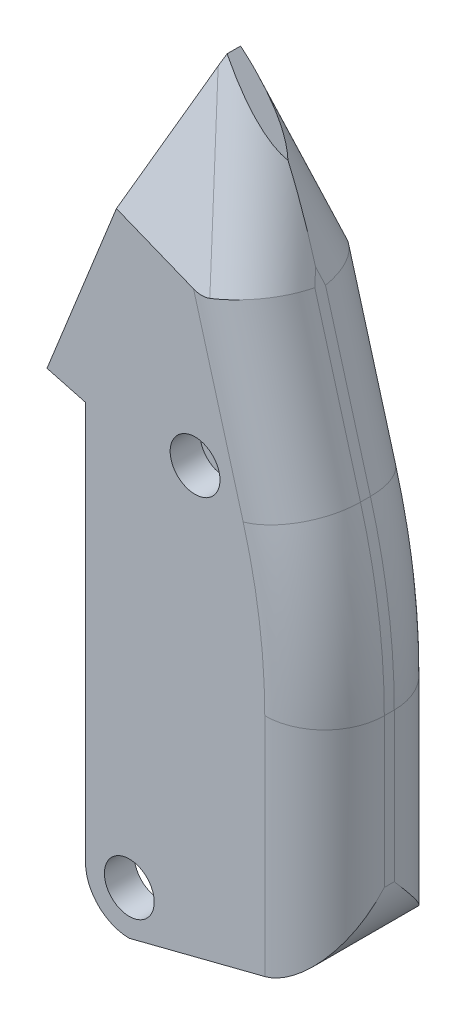
ISO-10303-21;
HEADER;
FILE_DESCRIPTION(('STEP AP214'),'2;1');
FILE_NAME('part.step','',(''),(''),'','','');
FILE_SCHEMA(('AUTOMOTIVE_DESIGN { 1 0 10303 214 1 1 1 1 }'));
ENDSEC;
DATA;
#1=APPLICATION_CONTEXT('core data for automotive mechanical design processes');
#2=APPLICATION_PROTOCOL_DEFINITION('international standard','automotive_design',2000,#1);
#3=PRODUCT_CONTEXT('',#1,'mechanical');
#4=PRODUCT('Part','Part','',(#3));
#5=PRODUCT_RELATED_PRODUCT_CATEGORY('part','',(#4));
#6=PRODUCT_DEFINITION_FORMATION('','',#4);
#7=PRODUCT_DEFINITION_CONTEXT('part definition',#1,'design');
#8=PRODUCT_DEFINITION('design','',#6,#7);
#9=PRODUCT_DEFINITION_SHAPE('','',#8);
#10=(LENGTH_UNIT() NAMED_UNIT(*) SI_UNIT(.MILLI.,.METRE.));
#11=(NAMED_UNIT(*) PLANE_ANGLE_UNIT() SI_UNIT($,.RADIAN.));
#12=(NAMED_UNIT(*) SI_UNIT($,.STERADIAN.) SOLID_ANGLE_UNIT());
#13=UNCERTAINTY_MEASURE_WITH_UNIT(LENGTH_MEASURE(1.E-05),#10,'distance_accuracy_value','');
#14=(GEOMETRIC_REPRESENTATION_CONTEXT(3) GLOBAL_UNCERTAINTY_ASSIGNED_CONTEXT((#13)) GLOBAL_UNIT_ASSIGNED_CONTEXT((#10,
#11,#12)) REPRESENTATION_CONTEXT('',''));
#15=CARTESIAN_POINT('',(0.,0.,0.));
#16=DIRECTION('',(0.,0.,1.));
#17=DIRECTION('',(1.,0.,0.));
#18=AXIS2_PLACEMENT_3D('',#15,#16,#17);
#19=CARTESIAN_POINT('',(15.6745495031514,4.39337889240954,3.25));
#20=DIRECTION('',(0.962892130260791,0.269886541868682,0.));
#21=DIRECTION('',(-0.269886541868682,0.962892130260791,0.));
#22=AXIS2_PLACEMENT_3D('',#19,#20,#21);
#23=PLANE('',#22);
#24=DIRECTION('',(-0.256891711883263,0.916529612736203,-0.306561767582509));
#25=VECTOR('',#24,1.);
#26=CARTESIAN_POINT('',(9.13133192408431,27.7380505823872,0.988569777283912));
#27=LINE('',#26,#25);
#28=CARTESIAN_POINT('',(8.31980787462291,30.6333788019172,0.0201374163689158));
#29=VERTEX_POINT('',#28);
#30=CARTESIAN_POINT('',(8.51242743404336,29.9461572138526,0.25));
#31=VERTEX_POINT('',#30);
#32=EDGE_CURVE('E532',#29,#31,#27,.F.);
#33=ORIENTED_EDGE('',*,*,#32,.T.);
#34=DIRECTION('',(0.269886541868682,-0.962892130260791,0.));
#35=VECTOR('',#34,1.);
#36=CARTESIAN_POINT('',(15.6745495031514,4.39337889240954,0.25));
#37=LINE('',#36,#35);
#38=CARTESIAN_POINT('',(10.8051265943974,21.7663422320644,0.250000000000001));
#39=VERTEX_POINT('',#38);
#40=EDGE_CURVE('E541',#31,#39,#37,.T.);
#41=ORIENTED_EDGE('',*,*,#40,.T.);
#42=DIRECTION('',(0.,0.,-1.));
#43=VECTOR('',#42,1.);
#44=CARTESIAN_POINT('',(10.8051265943974,21.7663422320644,3.25));
#45=LINE('',#44,#43);
#46=CARTESIAN_POINT('',(10.8051265943974,21.7663422320644,-0.249999999999999));
#47=VERTEX_POINT('',#46);
#48=EDGE_CURVE('E430',#39,#47,#45,.T.);
#49=ORIENTED_EDGE('',*,*,#48,.T.);
#50=DIRECTION('',(0.269886541868682,-0.962892130260791,0.));
#51=VECTOR('',#50,1.);
#52=CARTESIAN_POINT('',(15.6745495031514,4.39337889240954,-0.25));
#53=LINE('',#52,#51);
#54=CARTESIAN_POINT('',(8.54947734160673,29.8139717992979,-0.25));
#55=VERTEX_POINT('',#54);
#56=EDGE_CURVE('E536',#47,#55,#53,.F.);
#57=ORIENTED_EDGE('',*,*,#56,.T.);
#58=DIRECTION('',(-0.257236862314935,0.917761028842069,0.302562209479497));
#59=VECTOR('',#58,1.);
#60=CARTESIAN_POINT('',(14.7498871396659,7.6923581849071,-7.54292711509717));
#61=LINE('',#60,#59);
#62=EDGE_CURVE('E489',#55,#29,#61,.T.);
#63=ORIENTED_EDGE('',*,*,#62,.T.);
#64=EDGE_LOOP('',(#33,#41,#49,#57,#63));
#65=FACE_BOUND('',#64,.T.);
#66=ADVANCED_FACE('F55',(#65),#23,.T.);
#67=CARTESIAN_POINT('',(21.0816067768218,16.7397778493892,3.25));
#68=DIRECTION('',(0.783137949458292,0.621848013680403,0.));
#69=DIRECTION('',(-0.621848013680403,0.783137949458291,0.));
#70=AXIS2_PLACEMENT_3D('',#67,#68,#69);
#71=PLANE('',#70);
#72=DIRECTION('',(0.,0.,-1.));
#73=VECTOR('',#72,1.);
#74=CARTESIAN_POINT('',(4.2,38.,3.25));
#75=LINE('',#74,#73);
#76=CARTESIAN_POINT('',(4.2,38.,0.341040163928345));
#77=VERTEX_POINT('',#76);
#78=CARTESIAN_POINT('',(4.2,38.,-0.334765480072377));
#79=VERTEX_POINT('',#78);
#80=EDGE_CURVE('E424',#77,#79,#75,.T.);
#81=ORIENTED_EDGE('',*,*,#80,.F.);
#82=CARTESIAN_POINT('',(2.56081248950632,40.0643467816968,-3.40515823827877));
#83=DIRECTION('',(0.783137949458292,0.621848013680403,0.));
#84=DIRECTION('',(0.587055054774574,-0.739320672738483,0.329804950728668));
#85=AXIS2_PLACEMENT_3D('',#82,#83,#84);
#86=ELLIPSE('',#85,8.13536221615661,3.);
#87=CARTESIAN_POINT('',(6.92420874752517,34.569207900486,0.0113898786200839));
#88=VERTEX_POINT('',#87);
#89=EDGE_CURVE('E456',#77,#88,#86,.T.);
#90=ORIENTED_EDGE('',*,*,#89,.T.);
#91=CARTESIAN_POINT('',(2.56081248950632,40.0643467816968,3.39620898333385));
#92=DIRECTION('',(0.783137949458292,0.621848013680403,0.));
#93=DIRECTION('',(-0.58796822839997,0.740470697993463,0.325571048782405));
#94=AXIS2_PLACEMENT_3D('',#91,#92,#93);
#95=ELLIPSE('',#94,8.12444650308404,3.);
#96=EDGE_CURVE('E444',#88,#79,#95,.T.);
#97=ORIENTED_EDGE('',*,*,#96,.T.);
#98=EDGE_LOOP('',(#81,#90,#97));
#99=FACE_BOUND('',#98,.T.);
#100=ADVANCED_FACE('F370',(#99),#71,.T.);
#101=CARTESIAN_POINT('',(0.,0.,-3.25));
#102=DIRECTION('',(0.,0.,-1.));
#103=DIRECTION('',(1.,0.,0.));
#104=AXIS2_PLACEMENT_3D('',#101,#102,#103);
#105=PLANE('',#104);
#106=CARTESIAN_POINT('',(5.5,22.2,-3.25));
#107=DIRECTION('',(0.,0.,-1.));
#108=DIRECTION('',(-1.,0.,0.));
#109=AXIS2_PLACEMENT_3D('',#106,#107,#108);
#110=CIRCLE('',#109,1.25);
#111=CARTESIAN_POINT('',(4.25,22.2,-3.25));
#112=VERTEX_POINT('',#111);
#113=EDGE_CURVE('E611',#112,#112,#110,.T.);
#114=ORIENTED_EDGE('',*,*,#113,.F.);
#115=EDGE_LOOP('',(#114));
#116=FACE_BOUND('',#115,.T.);
#117=CARTESIAN_POINT('',(2.2,2.2,-3.25));
#118=DIRECTION('',(0.,0.,-1.));
#119=DIRECTION('',(-1.,0.,0.));
#120=AXIS2_PLACEMENT_3D('',#117,#118,#119);
#121=CIRCLE('',#120,1.25);
#122=CARTESIAN_POINT('',(0.95,2.2,-3.25));
#123=VERTEX_POINT('',#122);
#124=EDGE_CURVE('E463',#123,#123,#121,.T.);
#125=ORIENTED_EDGE('',*,*,#124,.F.);
#126=EDGE_LOOP('',(#125));
#127=FACE_BOUND('',#126,.T.);
#128=DIRECTION('',(0.,1.,0.));
#129=VECTOR('',#128,1.);
#130=CARTESIAN_POINT('',(9.,3.35768324811196,-3.25));
#131=LINE('',#130,#129);
#132=CARTESIAN_POINT('',(8.99999999999999,13.0759955838928,-3.25));
#133=VERTEX_POINT('',#132);
#134=CARTESIAN_POINT('',(9.,1.73700656767032,-3.25));
#135=VERTEX_POINT('',#134);
#136=EDGE_CURVE('E498',#133,#135,#131,.F.);
#137=ORIENTED_EDGE('',*,*,#136,.T.);
#138=CARTESIAN_POINT('',(8.,5.60998991387773,-3.25));
#139=DIRECTION('',(0.,0.,-1.));
#140=DIRECTION('',(-1.,0.,0.));
#141=AXIS2_PLACEMENT_3D('',#138,#139,#140);
#142=CIRCLE('',#141,4.);
#143=CARTESIAN_POINT('',(8.98997307339635,1.73443146199623,-3.25));
#144=VERTEX_POINT('',#143);
#145=EDGE_CURVE('E12',#135,#144,#142,.T.);
#146=ORIENTED_EDGE('',*,*,#145,.T.);
#147=DIRECTION('',(0.968889612970377,0.247493268349088,0.));
#148=VECTOR('',#147,1.);
#149=CARTESIAN_POINT('',(0.134756419331851,-0.527546045363748,-3.25));
#150=LINE('',#149,#148);
#151=CARTESIAN_POINT('',(2.2,0.,-3.25));
#152=VERTEX_POINT('',#151);
#153=EDGE_CURVE('E496',#152,#144,#150,.T.);
#154=ORIENTED_EDGE('',*,*,#153,.F.);
#155=CARTESIAN_POINT('',(2.2,2.2,-3.25));
#156=DIRECTION('',(0.,0.,1.));
#157=DIRECTION('',(1.,0.,0.));
#158=AXIS2_PLACEMENT_3D('',#155,#156,#157);
#159=CIRCLE('',#158,2.2);
#160=CARTESIAN_POINT('',(0.,2.2,-3.25));
#161=VERTEX_POINT('',#160);
#162=EDGE_CURVE('E504',#152,#161,#159,.F.);
#163=ORIENTED_EDGE('',*,*,#162,.T.);
#164=DIRECTION('',(0.,1.,0.));
#165=VECTOR('',#164,1.);
#166=CARTESIAN_POINT('',(0.,0.,-3.25));
#167=LINE('',#166,#165);
#168=CARTESIAN_POINT('',(0.,22.2,-3.25));
#169=VERTEX_POINT('',#168);
#170=EDGE_CURVE('E240',#161,#169,#167,.T.);
#171=ORIENTED_EDGE('',*,*,#170,.T.);
#172=DIRECTION('',(0.966437683386518,-0.256901156343251,0.));
#173=VECTOR('',#172,1.);
#174=CARTESIAN_POINT('',(0.,22.2,-3.25));
#175=LINE('',#174,#173);
#176=CARTESIAN_POINT('',(-1.93287536677304,22.7138023126865,-3.25));
#177=VERTEX_POINT('',#176);
#178=EDGE_CURVE('E226',#177,#169,#175,.T.);
#179=ORIENTED_EDGE('',*,*,#178,.F.);
#180=DIRECTION('',(-0.372353337244604,-0.928091047388567,0.));
#181=VECTOR('',#180,1.);
#182=CARTESIAN_POINT('',(-1.93287536677304,22.7138023126865,-3.25));
#183=LINE('',#182,#181);
#184=CARTESIAN_POINT('',(1.50906346997588,31.2928381384007,-3.25));
#185=VERTEX_POINT('',#184);
#186=EDGE_CURVE('E213',#185,#177,#183,.T.);
#187=ORIENTED_EDGE('',*,*,#186,.F.);
#188=DIRECTION('',(0.928091047388567,-0.372353337244604,0.));
#189=VECTOR('',#188,1.);
#190=CARTESIAN_POINT('',(11.023337255511,27.4756785984276,-3.25));
#191=LINE('',#190,#189);
#192=CARTESIAN_POINT('',(5.46410991783306,29.706059828276,-3.25));
#193=VERTEX_POINT('',#192);
#194=EDGE_CURVE('E246',#185,#193,#191,.T.);
#195=ORIENTED_EDGE('',*,*,#194,.T.);
#196=DIRECTION('',(0.269886541868682,-0.962892130260791,0.));
#197=VECTOR('',#196,1.);
#198=CARTESIAN_POINT('',(12.7858731123691,3.58371926680349,-3.25));
#199=LINE('',#198,#197);
#200=CARTESIAN_POINT('',(7.91645020361507,20.9566826064584,-3.25));
#201=VERTEX_POINT('',#200);
#202=EDGE_CURVE('E548',#193,#201,#199,.T.);
#203=ORIENTED_EDGE('',*,*,#202,.T.);
#204=CARTESIAN_POINT('',(-20.2,13.0759955838928,-3.25));
#205=DIRECTION('',(0.,0.,-1.));
#206=DIRECTION('',(-1.,0.,0.));
#207=AXIS2_PLACEMENT_3D('',#204,#205,#206);
#208=CIRCLE('',#207,29.2);
#209=EDGE_CURVE('E546',#201,#133,#208,.T.);
#210=ORIENTED_EDGE('',*,*,#209,.T.);
#211=EDGE_LOOP('',(#137,#146,#154,#163,#171,#179,#187,#195,#203,#210));
#212=FACE_BOUND('',#211,.T.);
#213=ADVANCED_FACE('F238',(#116,#127,#212),#105,.T.);
#214=CARTESIAN_POINT('',(-1.93287536677304,22.7138023126865,-3.25));
#215=DIRECTION('',(-0.928091047388566,0.372353337244604,0.));
#216=DIRECTION('',(-0.372353337244604,-0.928091047388566,0.));
#217=AXIS2_PLACEMENT_3D('',#214,#215,#216);
#218=PLANE('',#217);
#219=DIRECTION('',(-0.344995888671787,-0.859902580789313,0.376225183037291));
#220=VECTOR('',#219,1.);
#221=CARTESIAN_POINT('',(-0.595859367947193,26.0463159619744,5.59284800757703));
#222=LINE('',#221,#220);
#223=CARTESIAN_POINT('',(3.99588914496352,37.4912534996034,0.58545087197078));
#224=VERTEX_POINT('',#223);
#225=CARTESIAN_POINT('',(1.55251603816391,31.4011437059559,3.25));
#226=VERTEX_POINT('',#225);
#227=EDGE_CURVE('E479',#224,#226,#222,.T.);
#228=ORIENTED_EDGE('',*,*,#227,.F.);
#229=CARTESIAN_POINT('',(3.57562303758533,36.4437398270663,-2.1941339000477));
#230=DIRECTION('',(-0.928091047388566,0.372353337244604,0.));
#231=DIRECTION('',(-0.344995888671787,-0.859902580789313,0.376225183037291));
#232=AXIS2_PLACEMENT_3D('',#229,#230,#231);
#233=ELLIPSE('',#232,5.175164143608,3.);
#234=EDGE_CURVE('E439',#224,#77,#233,.T.);
#235=ORIENTED_EDGE('',*,*,#234,.T.);
#236=ORIENTED_EDGE('',*,*,#80,.T.);
#237=CARTESIAN_POINT('',(3.57562303758533,36.4437398270663,2.20258798023683));
#238=DIRECTION('',(-0.928091047388566,0.372353337244604,0.));
#239=DIRECTION('',(0.345694724959364,0.861644430901063,0.371569686374513));
#240=AXIS2_PLACEMENT_3D('',#237,#238,#239);
#241=ELLIPSE('',#240,5.16822030934542,3.);
#242=CARTESIAN_POINT('',(3.99068867580677,37.4782913252818,-0.582627220337068));
#243=VERTEX_POINT('',#242);
#244=EDGE_CURVE('E437',#79,#243,#241,.T.);
#245=ORIENTED_EDGE('',*,*,#244,.T.);
#246=DIRECTION('',(-0.345694724959364,-0.861644430901063,-0.371569686374513));
#247=VECTOR('',#246,1.);
#248=CARTESIAN_POINT('',(-1.45766741365078,23.8982585880197,-6.43878821224801));
#249=LINE('',#248,#247);
#250=EDGE_CURVE('E221',#243,#185,#249,.T.);
#251=ORIENTED_EDGE('',*,*,#250,.T.);
#252=ORIENTED_EDGE('',*,*,#186,.T.);
#253=DIRECTION('',(0.,0.,1.));
#254=VECTOR('',#253,1.);
#255=CARTESIAN_POINT('',(-1.93287536677304,22.7138023126865,-3.25));
#256=LINE('',#255,#254);
#257=CARTESIAN_POINT('',(-1.93287536677304,22.7138023126865,3.25));
#258=VERTEX_POINT('',#257);
#259=EDGE_CURVE('E218',#177,#258,#256,.T.);
#260=ORIENTED_EDGE('',*,*,#259,.T.);
#261=DIRECTION('',(-0.372353337244604,-0.928091047388567,0.));
#262=VECTOR('',#261,1.);
#263=CARTESIAN_POINT('',(-1.93287536677304,22.7138023126865,3.25));
#264=LINE('',#263,#262);
#265=EDGE_CURVE('E244',#226,#258,#264,.T.);
#266=ORIENTED_EDGE('',*,*,#265,.F.);
#267=EDGE_LOOP('',(#228,#235,#236,#245,#251,#252,#260,#266));
#268=FACE_BOUND('',#267,.T.);
#269=ADVANCED_FACE('F216',(#268),#218,.T.);
#270=CARTESIAN_POINT('',(0.134756419331851,-0.527546045363748,3.25));
#271=DIRECTION('',(-0.247493268349088,0.968889612970377,0.));
#272=DIRECTION('',(-0.968889612970377,-0.247493268349088,0.));
#273=AXIS2_PLACEMENT_3D('',#270,#271,#272);
#274=PLANE('',#273);
#275=DIRECTION('',(0.,0.,-1.));
#276=VECTOR('',#275,1.);
#277=CARTESIAN_POINT('',(8.98997307339635,1.73443146199623,3.25));
#278=LINE('',#277,#276);
#279=CARTESIAN_POINT('',(8.98997307339635,1.73443146199622,-0.25));
#280=VERTEX_POINT('',#279);
#281=CARTESIAN_POINT('',(8.98997307339635,1.73443146199622,0.25));
#282=VERTEX_POINT('',#281);
#283=EDGE_CURVE('E458',#280,#282,#278,.F.);
#284=ORIENTED_EDGE('',*,*,#283,.T.);
#285=DIRECTION('',(0.,0.,-1.));
#286=VECTOR('',#285,1.);
#287=CARTESIAN_POINT('',(8.98997307339635,1.73443146199623,3.25));
#288=LINE('',#287,#286);
#289=CARTESIAN_POINT('',(8.98997307339635,1.73443146199622,3.25));
#290=VERTEX_POINT('',#289);
#291=EDGE_CURVE('E483',#282,#290,#288,.F.);
#292=ORIENTED_EDGE('',*,*,#291,.T.);
#293=DIRECTION('',(0.968889612970377,0.247493268349088,0.));
#294=VECTOR('',#293,1.);
#295=CARTESIAN_POINT('',(0.134756419331851,-0.527546045363748,3.25));
#296=LINE('',#295,#294);
#297=CARTESIAN_POINT('',(2.2,0.,3.25));
#298=VERTEX_POINT('',#297);
#299=EDGE_CURVE('E400',#298,#290,#296,.T.);
#300=ORIENTED_EDGE('',*,*,#299,.F.);
#301=DIRECTION('',(0.,0.,-1.));
#302=VECTOR('',#301,1.);
#303=CARTESIAN_POINT('',(2.2,0.,3.25));
#304=LINE('',#303,#302);
#305=CARTESIAN_POINT('',(2.2,0.,1.75));
#306=VERTEX_POINT('',#305);
#307=EDGE_CURVE('E416',#298,#306,#304,.T.);
#308=ORIENTED_EDGE('',*,*,#307,.T.);
#309=DIRECTION('',(0.968889612970377,0.247493268349088,0.));
#310=VECTOR('',#309,1.);
#311=CARTESIAN_POINT('',(0.134756419331851,-0.527546045363748,1.75));
#312=LINE('',#311,#310);
#313=CARTESIAN_POINT('',(4.58826385993151,0.610058380708979,1.75));
#314=VERTEX_POINT('',#313);
#315=EDGE_CURVE('E847',#306,#314,#312,.T.);
#316=ORIENTED_EDGE('',*,*,#315,.T.);
#317=DIRECTION('',(0.,0.,-1.));
#318=VECTOR('',#317,1.);
#319=CARTESIAN_POINT('',(4.58826385993151,0.610058380708979,1.75));
#320=LINE('',#319,#318);
#321=CARTESIAN_POINT('',(4.58826385993151,0.610058380708979,-1.75));
#322=VERTEX_POINT('',#321);
#323=EDGE_CURVE('E412',#314,#322,#320,.T.);
#324=ORIENTED_EDGE('',*,*,#323,.T.);
#325=DIRECTION('',(0.968889612970377,0.247493268349088,0.));
#326=VECTOR('',#325,1.);
#327=CARTESIAN_POINT('',(0.134756419331851,-0.527546045363748,-1.75));
#328=LINE('',#327,#326);
#329=CARTESIAN_POINT('',(2.2,0.,-1.75));
#330=VERTEX_POINT('',#329);
#331=EDGE_CURVE('E502',#330,#322,#328,.T.);
#332=ORIENTED_EDGE('',*,*,#331,.F.);
#333=DIRECTION('',(0.,0.,1.));
#334=VECTOR('',#333,1.);
#335=CARTESIAN_POINT('',(2.2,0.,-3.25));
#336=LINE('',#335,#334);
#337=EDGE_CURVE('E501',#152,#330,#336,.T.);
#338=ORIENTED_EDGE('',*,*,#337,.F.);
#339=ORIENTED_EDGE('',*,*,#153,.T.);
#340=DIRECTION('',(0.,0.,-1.));
#341=VECTOR('',#340,1.);
#342=CARTESIAN_POINT('',(8.98997307339635,1.73443146199623,3.25));
#343=LINE('',#342,#341);
#344=EDGE_CURVE('E481',#144,#280,#343,.F.);
#345=ORIENTED_EDGE('',*,*,#344,.T.);
#346=EDGE_LOOP('',(#284,#292,#300,#308,#316,#324,#332,#338,#339,#345));
#347=FACE_BOUND('',#346,.T.);
#348=ADVANCED_FACE('F356',(#347),#274,.F.);
#349=CARTESIAN_POINT('',(12.,0.,3.25));
#350=DIRECTION('',(-1.,0.,0.));
#351=DIRECTION('',(0.,0.,1.));
#352=AXIS2_PLACEMENT_3D('',#349,#350,#351);
#353=PLANE('',#352);
#354=DIRECTION('',(0.,1.,0.));
#355=VECTOR('',#354,1.);
#356=CARTESIAN_POINT('',(12.,3.35768324811196,0.25));
#357=LINE('',#356,#355);
#358=CARTESIAN_POINT('',(12.,13.0759955838928,0.250000000000001));
#359=VERTEX_POINT('',#358);
#360=CARTESIAN_POINT('',(12.,5.60998991387773,0.25));
#361=VERTEX_POINT('',#360);
#362=EDGE_CURVE('E308',#359,#361,#357,.F.);
#363=ORIENTED_EDGE('',*,*,#362,.T.);
#364=DIRECTION('',(0.,0.,-1.));
#365=VECTOR('',#364,1.);
#366=CARTESIAN_POINT('',(12.,5.60998991387773,3.25));
#367=LINE('',#366,#365);
#368=CARTESIAN_POINT('',(12.,5.60998991387773,-0.25));
#369=VERTEX_POINT('',#368);
#370=EDGE_CURVE('E80',#361,#369,#367,.T.);
#371=ORIENTED_EDGE('',*,*,#370,.T.);
#372=DIRECTION('',(0.,1.,0.));
#373=VECTOR('',#372,1.);
#374=CARTESIAN_POINT('',(12.,13.0759955838928,-0.25));
#375=LINE('',#374,#373);
#376=CARTESIAN_POINT('',(12.,13.0759955838928,-0.249999999999999));
#377=VERTEX_POINT('',#376);
#378=EDGE_CURVE('E305',#369,#377,#375,.T.);
#379=ORIENTED_EDGE('',*,*,#378,.T.);
#380=DIRECTION('',(0.,0.,-1.));
#381=VECTOR('',#380,1.);
#382=CARTESIAN_POINT('',(12.,13.0759955838928,3.25));
#383=LINE('',#382,#381);
#384=EDGE_CURVE('E296',#359,#377,#383,.T.);
#385=ORIENTED_EDGE('',*,*,#384,.F.);
#386=EDGE_LOOP('',(#363,#371,#379,#385));
#387=FACE_BOUND('',#386,.T.);
#388=ADVANCED_FACE('F359',(#387),#353,.F.);
#389=CARTESIAN_POINT('',(-20.2,13.0759955838928,3.25));
#390=DIRECTION('',(0.,0.,-1.));
#391=DIRECTION('',(-1.,0.,0.));
#392=AXIS2_PLACEMENT_3D('',#389,#390,#391);
#393=CYLINDRICAL_SURFACE('',#392,32.2);
#394=ORIENTED_EDGE('',*,*,#48,.F.);
#395=CARTESIAN_POINT('',(-20.2,13.0759955838928,0.25));
#396=DIRECTION('',(0.,0.,1.));
#397=DIRECTION('',(1.,0.,0.));
#398=AXIS2_PLACEMENT_3D('',#395,#396,#397);
#399=CIRCLE('',#398,32.2);
#400=EDGE_CURVE('E448',#39,#359,#399,.F.);
#401=ORIENTED_EDGE('',*,*,#400,.T.);
#402=ORIENTED_EDGE('',*,*,#384,.T.);
#403=CARTESIAN_POINT('',(-20.2,13.0759955838928,-0.25));
#404=DIRECTION('',(0.,0.,-1.));
#405=DIRECTION('',(-1.,0.,0.));
#406=AXIS2_PLACEMENT_3D('',#403,#404,#405);
#407=CIRCLE('',#406,32.2);
#408=EDGE_CURVE('E451',#377,#47,#407,.F.);
#409=ORIENTED_EDGE('',*,*,#408,.T.);
#410=EDGE_LOOP('',(#394,#401,#402,#409));
#411=FACE_BOUND('',#410,.T.);
#412=ADVANCED_FACE('F363',(#411),#393,.T.);
#413=CARTESIAN_POINT('',(0.,0.,3.25));
#414=DIRECTION('',(-1.,0.,0.));
#415=DIRECTION('',(0.,0.,1.));
#416=AXIS2_PLACEMENT_3D('',#413,#414,#415);
#417=PLANE('',#416);
#418=DIRECTION('',(0.,1.,0.));
#419=VECTOR('',#418,1.);
#420=CARTESIAN_POINT('',(0.,0.,1.75));
#421=LINE('',#420,#419);
#422=CARTESIAN_POINT('',(0.,2.2,1.75));
#423=VERTEX_POINT('',#422);
#424=CARTESIAN_POINT('',(0.,22.2,1.75));
#425=VERTEX_POINT('',#424);
#426=EDGE_CURVE('E287',#423,#425,#421,.T.);
#427=ORIENTED_EDGE('',*,*,#426,.F.);
#428=DIRECTION('',(0.,0.,-1.));
#429=VECTOR('',#428,1.);
#430=CARTESIAN_POINT('',(0.,2.2,3.25));
#431=LINE('',#430,#429);
#432=CARTESIAN_POINT('',(0.,2.2,3.25));
#433=VERTEX_POINT('',#432);
#434=EDGE_CURVE('E418',#433,#423,#431,.T.);
#435=ORIENTED_EDGE('',*,*,#434,.F.);
#436=DIRECTION('',(0.,1.,0.));
#437=VECTOR('',#436,1.);
#438=CARTESIAN_POINT('',(0.,0.,3.25));
#439=LINE('',#438,#437);
#440=CARTESIAN_POINT('',(0.,22.2,3.25));
#441=VERTEX_POINT('',#440);
#442=EDGE_CURVE('E408',#433,#441,#439,.T.);
#443=ORIENTED_EDGE('',*,*,#442,.T.);
#444=DIRECTION('',(0.,0.,-1.));
#445=VECTOR('',#444,1.);
#446=CARTESIAN_POINT('',(0.,22.2,3.25));
#447=LINE('',#446,#445);
#448=EDGE_CURVE('E421',#441,#425,#447,.T.);
#449=ORIENTED_EDGE('',*,*,#448,.T.);
#450=EDGE_LOOP('',(#427,#435,#443,#449));
#451=FACE_BOUND('',#450,.T.);
#452=ADVANCED_FACE('F366',(#451),#417,.T.);
#453=CARTESIAN_POINT('',(2.2,2.2,3.25));
#454=DIRECTION('',(0.,0.,-1.));
#455=DIRECTION('',(-1.,0.,0.));
#456=AXIS2_PLACEMENT_3D('',#453,#454,#455);
#457=CYLINDRICAL_SURFACE('',#456,2.2);
#458=CARTESIAN_POINT('',(2.2,2.2,1.75));
#459=DIRECTION('',(0.,0.,1.));
#460=DIRECTION('',(1.,0.,0.));
#461=AXIS2_PLACEMENT_3D('',#458,#459,#460);
#462=CIRCLE('',#461,2.2);
#463=EDGE_CURVE('E272',#306,#423,#462,.F.);
#464=ORIENTED_EDGE('',*,*,#463,.F.);
#465=ORIENTED_EDGE('',*,*,#307,.F.);
#466=CARTESIAN_POINT('',(2.2,2.2,3.25));
#467=DIRECTION('',(0.,0.,1.));
#468=DIRECTION('',(1.,0.,0.));
#469=AXIS2_PLACEMENT_3D('',#466,#467,#468);
#470=CIRCLE('',#469,2.2);
#471=EDGE_CURVE('E405',#298,#433,#470,.F.);
#472=ORIENTED_EDGE('',*,*,#471,.T.);
#473=ORIENTED_EDGE('',*,*,#434,.T.);
#474=EDGE_LOOP('',(#464,#465,#472,#473));
#475=FACE_BOUND('',#474,.T.);
#476=ADVANCED_FACE('F377',(#475),#457,.T.);
#477=CARTESIAN_POINT('',(0.,0.,3.25));
#478=DIRECTION('',(0.,0.,1.));
#479=DIRECTION('',(1.,0.,0.));
#480=AXIS2_PLACEMENT_3D('',#477,#478,#479);
#481=PLANE('',#480);
#482=CARTESIAN_POINT('',(5.5,22.2,3.25));
#483=DIRECTION('',(0.,0.,1.));
#484=DIRECTION('',(1.,0.,0.));
#485=AXIS2_PLACEMENT_3D('',#482,#483,#484);
#486=CIRCLE('',#485,1.25);
#487=CARTESIAN_POINT('',(6.75,22.2,3.25));
#488=VERTEX_POINT('',#487);
#489=EDGE_CURVE('E392',#488,#488,#486,.T.);
#490=ORIENTED_EDGE('',*,*,#489,.F.);
#491=EDGE_LOOP('',(#490));
#492=FACE_BOUND('',#491,.T.);
#493=CARTESIAN_POINT('',(2.2,2.2,3.25));
#494=DIRECTION('',(0.,0.,1.));
#495=DIRECTION('',(1.,0.,0.));
#496=AXIS2_PLACEMENT_3D('',#493,#494,#495);
#497=CIRCLE('',#496,1.25);
#498=CARTESIAN_POINT('',(3.45,2.2,3.25));
#499=VERTEX_POINT('',#498);
#500=EDGE_CURVE('E396',#499,#499,#497,.T.);
#501=ORIENTED_EDGE('',*,*,#500,.F.);
#502=EDGE_LOOP('',(#501));
#503=FACE_BOUND('',#502,.T.);
#504=ORIENTED_EDGE('',*,*,#299,.T.);
#505=CARTESIAN_POINT('',(8.,5.60998991387773,3.25));
#506=DIRECTION('',(0.,0.,1.));
#507=DIRECTION('',(1.,0.,0.));
#508=AXIS2_PLACEMENT_3D('',#505,#506,#507);
#509=CIRCLE('',#508,4.);
#510=CARTESIAN_POINT('',(9.,1.73700656767031,3.25));
#511=VERTEX_POINT('',#510);
#512=EDGE_CURVE('E401',#290,#511,#509,.T.);
#513=ORIENTED_EDGE('',*,*,#512,.T.);
#514=DIRECTION('',(0.,1.,0.));
#515=VECTOR('',#514,1.);
#516=CARTESIAN_POINT('',(9.,13.0759955838928,3.25));
#517=LINE('',#516,#515);
#518=CARTESIAN_POINT('',(8.99999999999999,13.0759955838928,3.25));
#519=VERTEX_POINT('',#518);
#520=EDGE_CURVE('E303',#511,#519,#517,.T.);
#521=ORIENTED_EDGE('',*,*,#520,.T.);
#522=CARTESIAN_POINT('',(-20.2,13.0759955838928,3.25));
#523=DIRECTION('',(0.,0.,1.));
#524=DIRECTION('',(1.,0.,0.));
#525=AXIS2_PLACEMENT_3D('',#522,#523,#524);
#526=CIRCLE('',#525,29.2);
#527=CARTESIAN_POINT('',(7.91645020361507,20.9566826064584,3.25));
#528=VERTEX_POINT('',#527);
#529=EDGE_CURVE('E299',#519,#528,#526,.T.);
#530=ORIENTED_EDGE('',*,*,#529,.T.);
#531=DIRECTION('',(0.269886541868682,-0.962892130260791,0.));
#532=VECTOR('',#531,1.);
#533=CARTESIAN_POINT('',(12.7858731123691,3.58371926680349,3.25));
#534=LINE('',#533,#532);
#535=CARTESIAN_POINT('',(5.42440159961067,29.847729831002,3.25));
#536=VERTEX_POINT('',#535);
#537=EDGE_CURVE('E301',#528,#536,#534,.F.);
#538=ORIENTED_EDGE('',*,*,#537,.T.);
#539=DIRECTION('',(0.928091047388566,-0.372353337244604,0.));
#540=VECTOR('',#539,1.);
#541=CARTESIAN_POINT('',(11.0667898236991,27.5839841659828,3.25));
#542=LINE('',#541,#540);
#543=EDGE_CURVE('E295',#226,#536,#542,.T.);
#544=ORIENTED_EDGE('',*,*,#543,.F.);
#545=ORIENTED_EDGE('',*,*,#265,.T.);
#546=DIRECTION('',(0.966437683386518,-0.256901156343251,0.));
#547=VECTOR('',#546,1.);
#548=CARTESIAN_POINT('',(0.,22.2,3.25));
#549=LINE('',#548,#547);
#550=EDGE_CURVE('E227',#258,#441,#549,.T.);
#551=ORIENTED_EDGE('',*,*,#550,.T.);
#552=ORIENTED_EDGE('',*,*,#442,.F.);
#553=ORIENTED_EDGE('',*,*,#471,.F.);
#554=EDGE_LOOP('',(#504,#513,#521,#530,#538,#544,#545,#551,#552,#553));
#555=FACE_BOUND('',#554,.T.);
#556=ADVANCED_FACE('F380',(#492,#503,#555),#481,.T.);
#557=CARTESIAN_POINT('',(0.,22.2,1.75));
#558=CARTESIAN_POINT('',(1.06970196410582,23.9409952171326,1.75));
#559=CARTESIAN_POINT('',(4.28955658287507,27.106788872418,1.75));
#560=CARTESIAN_POINT('',(8.37398216404773,24.849012213542,1.75));
#561=CARTESIAN_POINT('',(9.17100453568842,22.4227108913741,1.75));
#562=CARTESIAN_POINT('',(8.31824136291589,20.2003348650735,1.75));
#563=CARTESIAN_POINT('',(7.91255498209849,17.0586639593693,1.75));
#564=CARTESIAN_POINT('',(8.00058107793937,14.1136474222062,1.75));
#565=CARTESIAN_POINT('',(7.26708788447851,11.5079380175671,1.75));
#566=CARTESIAN_POINT('',(6.56383292106094,9.29668448321563,1.75));
#567=CARTESIAN_POINT('',(4.97695347468543,5.70104010740679,1.75));
#568=CARTESIAN_POINT('',(5.03848499688045,2.51693039244009,1.75));
#569=CARTESIAN_POINT('',(4.5882638599315,0.610058380708979,1.75));
#570=B_SPLINE_CURVE_WITH_KNOTS('',3,(#557,#558,#559,#560,#561,#562,#563,#564,#565,#566,#567,
#568,#569),.UNSPECIFIED.,.F.,.F.,(4,1,1,1,1,1,1,1,1,1,4),(0.,0.197912925952324,
0.294921454860376,0.347999178580059,0.406849955399435,0.495888703373723,0.625075475207407,
0.660081321929189,0.731431202359635,0.827854583111971,1.),.UNSPECIFIED.);
#571=DIRECTION('',(0.,0.,-1.));
#572=VECTOR('',#571,1.);
#573=SURFACE_OF_LINEAR_EXTRUSION('',#570,#572);
#574=DIRECTION('',(0.,0.,-1.));
#575=VECTOR('',#574,1.);
#576=CARTESIAN_POINT('',(0.,22.2,1.75));
#577=LINE('',#576,#575);
#578=CARTESIAN_POINT('',(0.,22.2,-1.75));
#579=VERTEX_POINT('',#578);
#580=EDGE_CURVE('E409',#425,#579,#577,.T.);
#581=ORIENTED_EDGE('',*,*,#580,.T.);
#582=CARTESIAN_POINT('',(0.,22.2,-1.75));
#583=CARTESIAN_POINT('',(1.06970196410582,23.9409952171326,-1.75));
#584=CARTESIAN_POINT('',(4.28955658287507,27.106788872418,-1.75));
#585=CARTESIAN_POINT('',(8.37398216404773,24.849012213542,-1.75));
#586=CARTESIAN_POINT('',(9.17100453568842,22.4227108913741,-1.75));
#587=CARTESIAN_POINT('',(8.31824136291589,20.2003348650735,-1.75));
#588=CARTESIAN_POINT('',(7.91255498209849,17.0586639593693,-1.75));
#589=CARTESIAN_POINT('',(8.00058107793937,14.1136474222062,-1.75));
#590=CARTESIAN_POINT('',(7.26708788447851,11.5079380175671,-1.75));
#591=CARTESIAN_POINT('',(6.56383292106094,9.29668448321563,-1.75));
#592=CARTESIAN_POINT('',(4.97695347468543,5.70104010740679,-1.75));
#593=CARTESIAN_POINT('',(5.03848499688045,2.51693039244009,-1.75));
#594=CARTESIAN_POINT('',(4.5882638599315,0.610058380708979,-1.75));
#595=B_SPLINE_CURVE_WITH_KNOTS('',3,(#582,#583,#584,#585,#586,#587,#588,#589,#590,#591,#592,
#593,#594),.UNSPECIFIED.,.F.,.F.,(4,1,1,1,1,1,1,1,1,1,4),(0.,0.197912925952324,
0.294921454860376,0.347999178580059,0.406849955399435,0.495888703373723,0.625075475207407,
0.660081321929189,0.731431202359635,0.827854583111971,1.),.UNSPECIFIED.);
#596=EDGE_CURVE('E235',#579,#322,#595,.T.);
#597=ORIENTED_EDGE('',*,*,#596,.T.);
#598=ORIENTED_EDGE('',*,*,#323,.F.);
#599=EDGE_CURVE('E283',#425,#314,#570,.T.);
#600=ORIENTED_EDGE('',*,*,#599,.F.);
#601=EDGE_LOOP('',(#581,#597,#598,#600));
#602=FACE_BOUND('',#601,.T.);
#603=ADVANCED_FACE('F279',(#602),#573,.F.);
#604=CARTESIAN_POINT('',(0.,0.,1.75));
#605=DIRECTION('',(0.,0.,1.));
#606=DIRECTION('',(1.,0.,0.));
#607=AXIS2_PLACEMENT_3D('',#604,#605,#606);
#608=PLANE('',#607);
#609=CARTESIAN_POINT('',(5.5,22.2,1.75));
#610=DIRECTION('',(0.,0.,1.));
#611=DIRECTION('',(1.,0.,0.));
#612=AXIS2_PLACEMENT_3D('',#609,#610,#611);
#613=CIRCLE('',#612,1.25);
#614=CARTESIAN_POINT('',(6.75,22.2,1.75));
#615=VERTEX_POINT('',#614);
#616=EDGE_CURVE('E599',#615,#615,#613,.T.);
#617=ORIENTED_EDGE('',*,*,#616,.T.);
#618=EDGE_LOOP('',(#617));
#619=FACE_BOUND('',#618,.T.);
#620=CARTESIAN_POINT('',(2.2,2.2,1.75));
#621=DIRECTION('',(0.,0.,1.));
#622=DIRECTION('',(1.,0.,0.));
#623=AXIS2_PLACEMENT_3D('',#620,#621,#622);
#624=CIRCLE('',#623,1.25);
#625=CARTESIAN_POINT('',(3.45,2.2,1.75));
#626=VERTEX_POINT('',#625);
#627=EDGE_CURVE('E602',#626,#626,#624,.T.);
#628=ORIENTED_EDGE('',*,*,#627,.T.);
#629=EDGE_LOOP('',(#628));
#630=FACE_BOUND('',#629,.T.);
#631=ORIENTED_EDGE('',*,*,#599,.T.);
#632=ORIENTED_EDGE('',*,*,#315,.F.);
#633=ORIENTED_EDGE('',*,*,#463,.T.);
#634=ORIENTED_EDGE('',*,*,#426,.T.);
#635=EDGE_LOOP('',(#631,#632,#633,#634));
#636=FACE_BOUND('',#635,.T.);
#637=ADVANCED_FACE('F387',(#619,#630,#636),#608,.F.);
#638=CARTESIAN_POINT('',(0.,0.,-3.25));
#639=DIRECTION('',(-1.,0.,0.));
#640=DIRECTION('',(0.,0.,-1.));
#641=AXIS2_PLACEMENT_3D('',#638,#639,#640);
#642=PLANE('',#641);
#643=DIRECTION('',(0.,1.,0.));
#644=VECTOR('',#643,1.);
#645=CARTESIAN_POINT('',(0.,0.,-1.75));
#646=LINE('',#645,#644);
#647=CARTESIAN_POINT('',(0.,2.2,-1.75));
#648=VERTEX_POINT('',#647);
#649=EDGE_CURVE('E261',#648,#579,#646,.T.);
#650=ORIENTED_EDGE('',*,*,#649,.T.);
#651=DIRECTION('',(0.,0.,1.));
#652=VECTOR('',#651,1.);
#653=CARTESIAN_POINT('',(0.,22.2,-3.25));
#654=LINE('',#653,#652);
#655=EDGE_CURVE('E262',#169,#579,#654,.T.);
#656=ORIENTED_EDGE('',*,*,#655,.F.);
#657=ORIENTED_EDGE('',*,*,#170,.F.);
#658=DIRECTION('',(0.,0.,1.));
#659=VECTOR('',#658,1.);
#660=CARTESIAN_POINT('',(0.,2.2,-3.25));
#661=LINE('',#660,#659);
#662=EDGE_CURVE('E510',#161,#648,#661,.T.);
#663=ORIENTED_EDGE('',*,*,#662,.T.);
#664=EDGE_LOOP('',(#650,#656,#657,#663));
#665=FACE_BOUND('',#664,.T.);
#666=ADVANCED_FACE('F517',(#665),#642,.T.);
#667=CARTESIAN_POINT('',(2.2,2.2,-3.25));
#668=DIRECTION('',(0.,0.,1.));
#669=DIRECTION('',(-1.,0.,0.));
#670=AXIS2_PLACEMENT_3D('',#667,#668,#669);
#671=CYLINDRICAL_SURFACE('',#670,2.2);
#672=CARTESIAN_POINT('',(2.2,2.2,-1.75));
#673=DIRECTION('',(0.,0.,1.));
#674=DIRECTION('',(1.,0.,0.));
#675=AXIS2_PLACEMENT_3D('',#672,#673,#674);
#676=CIRCLE('',#675,2.2);
#677=EDGE_CURVE('E252',#330,#648,#676,.F.);
#678=ORIENTED_EDGE('',*,*,#677,.T.);
#679=ORIENTED_EDGE('',*,*,#662,.F.);
#680=ORIENTED_EDGE('',*,*,#162,.F.);
#681=ORIENTED_EDGE('',*,*,#337,.T.);
#682=EDGE_LOOP('',(#678,#679,#680,#681));
#683=FACE_BOUND('',#682,.T.);
#684=ADVANCED_FACE('F583',(#683),#671,.T.);
#685=CARTESIAN_POINT('',(0.,0.,-1.75));
#686=DIRECTION('',(0.,0.,-1.));
#687=DIRECTION('',(1.,0.,0.));
#688=AXIS2_PLACEMENT_3D('',#685,#686,#687);
#689=PLANE('',#688);
#690=CARTESIAN_POINT('',(5.5,22.2,-1.75));
#691=DIRECTION('',(0.,0.,-1.));
#692=DIRECTION('',(-1.,0.,0.));
#693=AXIS2_PLACEMENT_3D('',#690,#691,#692);
#694=CIRCLE('',#693,1.25);
#695=CARTESIAN_POINT('',(4.25,22.2,-1.75));
#696=VERTEX_POINT('',#695);
#697=EDGE_CURVE('E60',#696,#696,#694,.T.);
#698=ORIENTED_EDGE('',*,*,#697,.T.);
#699=EDGE_LOOP('',(#698));
#700=FACE_BOUND('',#699,.T.);
#701=CARTESIAN_POINT('',(2.2,2.2,-1.75));
#702=DIRECTION('',(0.,0.,-1.));
#703=DIRECTION('',(-1.,0.,0.));
#704=AXIS2_PLACEMENT_3D('',#701,#702,#703);
#705=CIRCLE('',#704,1.25);
#706=CARTESIAN_POINT('',(0.95,2.2,-1.75));
#707=VERTEX_POINT('',#706);
#708=EDGE_CURVE('E604',#707,#707,#705,.T.);
#709=ORIENTED_EDGE('',*,*,#708,.T.);
#710=EDGE_LOOP('',(#709));
#711=FACE_BOUND('',#710,.T.);
#712=ORIENTED_EDGE('',*,*,#596,.F.);
#713=ORIENTED_EDGE('',*,*,#649,.F.);
#714=ORIENTED_EDGE('',*,*,#677,.F.);
#715=ORIENTED_EDGE('',*,*,#331,.T.);
#716=EDGE_LOOP('',(#712,#713,#714,#715));
#717=FACE_BOUND('',#716,.T.);
#718=ADVANCED_FACE('F520',(#700,#711,#717),#689,.F.);
#719=CARTESIAN_POINT('',(0.,22.2,-3.25));
#720=DIRECTION('',(-0.256901156343251,-0.966437683386518,0.));
#721=DIRECTION('',(0.966437683386519,-0.256901156343251,0.));
#722=AXIS2_PLACEMENT_3D('',#719,#720,#721);
#723=PLANE('',#722);
#724=ORIENTED_EDGE('',*,*,#550,.F.);
#725=ORIENTED_EDGE('',*,*,#259,.F.);
#726=ORIENTED_EDGE('',*,*,#178,.T.);
#727=ORIENTED_EDGE('',*,*,#655,.T.);
#728=ORIENTED_EDGE('',*,*,#580,.F.);
#729=ORIENTED_EDGE('',*,*,#448,.F.);
#730=EDGE_LOOP('',(#724,#725,#726,#727,#728,#729));
#731=FACE_BOUND('',#730,.T.);
#732=ADVANCED_FACE('F231',(#731),#723,.T.);
#733=CARTESIAN_POINT('',(10.0588439623294,1.576372187565,-13.0138754336796));
#734=DIRECTION('',(0.138355212740481,0.344850499405162,-0.928405066857967));
#735=DIRECTION('',(0.,0.937420548642823,0.348199246096526));
#736=AXIS2_PLACEMENT_3D('',#733,#734,#735);
#737=PLANE('',#736);
#738=DIRECTION('',(-0.257236862314935,0.917761028842068,0.302562209479497));
#739=VECTOR('',#738,1.);
#740=CARTESIAN_POINT('',(13.8355450455153,2.35414376199738,-12.1621553969034));
#741=LINE('',#740,#739);
#742=CARTESIAN_POINT('',(6.19231232705153,29.6234124828566,-3.17217877359537));
#743=VERTEX_POINT('',#742);
#744=EDGE_CURVE('E447',#243,#743,#741,.F.);
#745=ORIENTED_EDGE('',*,*,#744,.T.);
#746=CARTESIAN_POINT('',(2.91352507026604,38.8059506945634,-0.25));
#747=DIRECTION('',(0.138355212740481,0.344850499405162,-0.928405066857967));
#748=DIRECTION('',(0.32510086024576,-0.901290235728467,-0.286330825528779));
#749=AXIS2_PLACEMENT_3D('',#746,#747,#748);
#750=ELLIPSE('',#749,10.1793733823714,3.);
#751=EDGE_CURVE('E552',#743,#193,#750,.T.);
#752=ORIENTED_EDGE('',*,*,#751,.T.);
#753=ORIENTED_EDGE('',*,*,#194,.F.);
#754=ORIENTED_EDGE('',*,*,#250,.F.);
#755=EDGE_LOOP('',(#745,#752,#753,#754));
#756=FACE_BOUND('',#755,.T.);
#757=ADVANCED_FACE('F566',(#756),#737,.T.);
#758=CARTESIAN_POINT('',(10.1077466376755,1.69826215239771,13.1502920710849));
#759=DIRECTION('',(-0.140088702459397,-0.349171224179034,-0.926528257339493));
#760=DIRECTION('',(0.,0.935755784768489,-0.352648708025862));
#761=AXIS2_PLACEMENT_3D('',#758,#759,#760);
#762=PLANE('',#761);
#763=ORIENTED_EDGE('',*,*,#543,.T.);
#764=CARTESIAN_POINT('',(2.91047058424892,38.8168483870808,0.25));
#765=DIRECTION('',(-0.140088702459397,-0.349171224179034,-0.926528257339493));
#766=DIRECTION('',(0.326568678238213,-0.899687989327782,0.289679858210886));
#767=AXIS2_PLACEMENT_3D('',#764,#765,#766);
#768=ELLIPSE('',#767,10.0534114825639,3.);
#769=CARTESIAN_POINT('',(6.16184081739084,29.7636439438804,3.17018966455333));
#770=VERTEX_POINT('',#769);
#771=EDGE_CURVE('E544',#536,#770,#768,.F.);
#772=ORIENTED_EDGE('',*,*,#771,.T.);
#773=DIRECTION('',(-0.256891711883263,0.916529612736203,-0.306561767582509));
#774=VECTOR('',#773,1.);
#775=CARTESIAN_POINT('',(5.10434438310057,33.5365441681991,1.90822611683271));
#776=LINE('',#775,#774);
#777=EDGE_CURVE('E530',#770,#224,#776,.T.);
#778=ORIENTED_EDGE('',*,*,#777,.T.);
#779=ORIENTED_EDGE('',*,*,#227,.T.);
#780=EDGE_LOOP('',(#763,#772,#778,#779));
#781=FACE_BOUND('',#780,.T.);
#782=ADVANCED_FACE('F328',(#781),#762,.F.);
#783=CARTESIAN_POINT('',(9.,0.,-0.25));
#784=DIRECTION('',(0.,-1.,0.));
#785=DIRECTION('',(0.,0.,-1.));
#786=AXIS2_PLACEMENT_3D('',#783,#784,#785);
#787=CYLINDRICAL_SURFACE('',#786,3.);
#788=ORIENTED_EDGE('',*,*,#378,.F.);
#789=CARTESIAN_POINT('',(12.,5.60998991387773,-0.25));
#790=CARTESIAN_POINT('',(11.9999999939753,5.6068027315404,-0.252760179065749));
#791=CARTESIAN_POINT('',(11.9999961848007,5.60361545288236,-0.255520443384037));
#792=CARTESIAN_POINT('',(11.9992962991408,5.31060622528777,-0.509273859835982));
#793=CARTESIAN_POINT('',(11.9671509736871,5.02003862456393,-0.760910869480488));
#794=CARTESIAN_POINT('',(11.8704439447433,4.58949727898129,-1.13143286386126));
#795=CARTESIAN_POINT('',(11.8300193904279,4.4466363309046,-1.25398179059924));
#796=CARTESIAN_POINT('',(11.7323564553031,4.16365546877141,-1.49545702324071));
#797=CARTESIAN_POINT('',(11.6751281610545,4.02353396400669,-1.61438545524175));
#798=CARTESIAN_POINT('',(11.5187710955342,3.69629949822425,-1.88992220404263));
#799=CARTESIAN_POINT('',(11.4119730588714,3.51087586390598,-2.0442852997091));
#800=CARTESIAN_POINT('',(11.1631730366432,3.15197171853858,-2.3374718415682));
#801=CARTESIAN_POINT('',(11.0212486567124,2.97846594236689,-2.47632857790751));
#802=CARTESIAN_POINT('',(10.7414212876187,2.69217379067569,-2.69754925324685));
#803=CARTESIAN_POINT('',(10.6119629709585,2.57528570356635,-2.78523775149334));
#804=CARTESIAN_POINT('',(10.3320783505242,2.35530181364319,-2.94282315416902));
#805=CARTESIAN_POINT('',(10.181678348558,2.25218902315121,-3.01274206991189));
#806=CARTESIAN_POINT('',(9.89388637153671,2.08366167611998,-3.11693520338559));
#807=CARTESIAN_POINT('',(9.76010963784032,2.01484871438279,-3.15557263741575));
#808=CARTESIAN_POINT('',(9.55188368210083,1.92251948353976,-3.19965511950782));
#809=CARTESIAN_POINT('',(9.4812470361247,1.89356826823103,-3.21203464540798));
#810=CARTESIAN_POINT('',(9.33782890873741,1.83956904574886,-3.23179531539195));
#811=CARTESIAN_POINT('',(9.26504838564954,1.8145193251516,-3.23917865844711));
#812=CARTESIAN_POINT('',(9.11759393175714,1.76850982462304,-3.24860765353265));
#813=CARTESIAN_POINT('',(9.04291448609475,1.74756399296907,-3.25063538464137));
#814=CARTESIAN_POINT('',(8.89251908092171,1.71006458613356,-3.24901720333822));
#815=CARTESIAN_POINT('',(8.81680318080261,1.69351076037732,-3.24537161468464));
#816=CARTESIAN_POINT('',(8.66437736007377,1.66478321622145,-3.2321551836229));
#817=CARTESIAN_POINT('',(8.58766448349775,1.65264827938549,-3.22253379402922));
#818=CARTESIAN_POINT('',(8.43460461731022,1.6329150012361,-3.19726707521638));
#819=CARTESIAN_POINT('',(8.35825785552656,1.62531919287662,-3.18161839060117));
#820=CARTESIAN_POINT('',(8.28249505498284,1.61997781566171,-3.16293437170767));
#821=B_SPLINE_CURVE_WITH_KNOTS('',3,(#789,#790,#791,#792,#793,#794,#795,#796,#797,#798,#799,
#800,#801,#802,#803,#804,#805,#806,#807,#808,#809,#810,#811,#812,#813,#814,#815,#816,#817,#818,
#819,#820),.UNSPECIFIED.,.F.,.F.,(4,2,2,2,2,2,2,2,2,2,2,2,2,2,2,4),(0.,0.0126491158035918,
1.16281102696004,1.73980637907461,2.3164560913271,3.10537829070492,3.8925728218464,
4.47627194126067,5.05924446492332,5.52317212910161,5.75493578435509,5.9865973669435,
6.21903315798116,6.45145568513454,6.68587148113173,6.92041796549825),.UNSPECIFIED.);
#822=EDGE_CURVE('E65',#369,#135,#821,.T.);
#823=ORIENTED_EDGE('',*,*,#822,.T.);
#824=ORIENTED_EDGE('',*,*,#136,.F.);
#825=CARTESIAN_POINT('',(9.,13.0759955838928,-0.25));
#826=DIRECTION('',(0.,1.,0.));
#827=DIRECTION('',(0.,0.,1.));
#828=AXIS2_PLACEMENT_3D('',#825,#826,#827);
#829=CIRCLE('',#828,3.);
#830=EDGE_CURVE('E476',#377,#133,#829,.T.);
#831=ORIENTED_EDGE('',*,*,#830,.F.);
#832=EDGE_LOOP('',(#788,#823,#824,#831));
#833=FACE_BOUND('',#832,.T.);
#834=ADVANCED_FACE('F323',(#833),#787,.T.);
#835=CARTESIAN_POINT('',(-20.2,13.0759955838928,-0.25));
#836=DIRECTION('',(0.,0.,-1.));
#837=DIRECTION('',(-1.,0.,0.));
#838=AXIS2_PLACEMENT_3D('',#835,#836,#837);
#839=TOROIDAL_SURFACE('',#838,29.2,3.);
#840=ORIENTED_EDGE('',*,*,#830,.T.);
#841=ORIENTED_EDGE('',*,*,#209,.F.);
#842=CARTESIAN_POINT('',(7.91645020361507,20.9566826064583,-0.25));
#843=DIRECTION('',(-0.269886541868683,0.962892130260791,0.));
#844=DIRECTION('',(-0.962892130260791,-0.269886541868684,0.));
#845=AXIS2_PLACEMENT_3D('',#842,#843,#844);
#846=CIRCLE('',#845,3.);
#847=EDGE_CURVE('E473',#47,#201,#846,.T.);
#848=ORIENTED_EDGE('',*,*,#847,.F.);
#849=ORIENTED_EDGE('',*,*,#408,.F.);
#850=EDGE_LOOP('',(#840,#841,#848,#849));
#851=FACE_BOUND('',#850,.T.);
#852=ADVANCED_FACE('F327',(#851),#839,.T.);
#853=CARTESIAN_POINT('',(12.7858731123691,3.58371926680349,-0.25));
#854=DIRECTION('',(0.269886541868682,-0.962892130260791,0.));
#855=DIRECTION('',(0.962892130260791,0.269886541868682,0.));
#856=AXIS2_PLACEMENT_3D('',#853,#854,#855);
#857=CYLINDRICAL_SURFACE('',#856,3.);
#858=ORIENTED_EDGE('',*,*,#202,.F.);
#859=ORIENTED_EDGE('',*,*,#751,.F.);
#860=CARTESIAN_POINT('',(5.66080095082436,29.0043121736918,-0.25));
#861=DIRECTION('',(-0.266705373673989,0.951542465329383,0.153085532720432));
#862=DIRECTION('',(0.0413157250360427,-0.147404854713286,0.988212942473282));
#863=AXIS2_PLACEMENT_3D('',#860,#861,#862);
#864=ELLIPSE('',#863,3.03578294824965,3.);
#865=EDGE_CURVE('E471',#55,#743,#864,.T.);
#866=ORIENTED_EDGE('',*,*,#865,.F.);
#867=ORIENTED_EDGE('',*,*,#56,.F.);
#868=ORIENTED_EDGE('',*,*,#847,.T.);
#869=EDGE_LOOP('',(#858,#859,#866,#867,#868));
#870=FACE_BOUND('',#869,.T.);
#871=ADVANCED_FACE('F331',(#870),#857,.T.);
#872=CARTESIAN_POINT('',(11.8612107488835,6.88269855930105,-7.54292711509717));
#873=DIRECTION('',(-0.257236862314935,0.917761028842068,0.302562209479497));
#874=DIRECTION('',(0.,-0.313098479708921,0.949720665250558));
#875=AXIS2_PLACEMENT_3D('',#872,#873,#874);
#876=CYLINDRICAL_SURFACE('',#875,3.);
#877=ORIENTED_EDGE('',*,*,#244,.F.);
#878=ORIENTED_EDGE('',*,*,#96,.F.);
#879=CARTESIAN_POINT('',(5.43113148384053,29.8237191763112,0.0201374163689167));
#880=DIRECTION('',(-0.000566632875996,0.00202161372429264,0.999997796000138));
#881=DIRECTION('',(0.269885947038781,-0.962890008046669,0.0020995225329606));
#882=AXIS2_PLACEMENT_3D('',#879,#880,#881);
#883=ELLIPSE('',#882,9.85018978392647,3.);
#884=EDGE_CURVE('E469',#29,#88,#883,.T.);
#885=ORIENTED_EDGE('',*,*,#884,.F.);
#886=ORIENTED_EDGE('',*,*,#62,.F.);
#887=ORIENTED_EDGE('',*,*,#865,.T.);
#888=ORIENTED_EDGE('',*,*,#744,.F.);
#889=EDGE_LOOP('',(#877,#878,#885,#886,#887,#888));
#890=FACE_BOUND('',#889,.T.);
#891=ADVANCED_FACE('F335',(#890),#876,.T.);
#892=CARTESIAN_POINT('',(13.3959052165017,1.40726723548465,9.52490148983537));
#893=DIRECTION('',(0.256891711883263,-0.916529612736203,0.306561767582509));
#894=DIRECTION('',(0.,-0.31720717900675,-0.948356265116955));
#895=AXIS2_PLACEMENT_3D('',#892,#893,#894);
#896=CYLINDRICAL_SURFACE('',#895,3.);
#897=ORIENTED_EDGE('',*,*,#234,.F.);
#898=ORIENTED_EDGE('',*,*,#777,.F.);
#899=CARTESIAN_POINT('',(5.62375104326099,29.1364975882466,0.250000000000003));
#900=DIRECTION('',(0.266618042559704,-0.951230888315982,0.155159970660025));
#901=DIRECTION('',(-0.0418755879178804,0.149402314680034,0.987889357926676));
#902=AXIS2_PLACEMENT_3D('',#899,#900,#901);
#903=ELLIPSE('',#902,3.03677732321788,3.);
#904=EDGE_CURVE('E466',#31,#770,#903,.T.);
#905=ORIENTED_EDGE('',*,*,#904,.F.);
#906=ORIENTED_EDGE('',*,*,#32,.F.);
#907=ORIENTED_EDGE('',*,*,#884,.T.);
#908=ORIENTED_EDGE('',*,*,#89,.F.);
#909=EDGE_LOOP('',(#897,#898,#905,#906,#907,#908));
#910=FACE_BOUND('',#909,.T.);
#911=ADVANCED_FACE('F339',(#910),#896,.T.);
#912=CARTESIAN_POINT('',(12.7858731123691,3.58371926680349,0.25));
#913=DIRECTION('',(0.269886541868682,-0.962892130260791,0.));
#914=DIRECTION('',(0.962892130260791,0.269886541868682,0.));
#915=AXIS2_PLACEMENT_3D('',#912,#913,#914);
#916=CYLINDRICAL_SURFACE('',#915,3.);
#917=ORIENTED_EDGE('',*,*,#771,.F.);
#918=ORIENTED_EDGE('',*,*,#537,.F.);
#919=CARTESIAN_POINT('',(7.91645020361507,20.9566826064584,0.25));
#920=DIRECTION('',(0.269886541868682,-0.962892130260791,0.));
#921=DIRECTION('',(0.962892130260791,0.269886541868682,0.));
#922=AXIS2_PLACEMENT_3D('',#919,#920,#921);
#923=CIRCLE('',#922,3.);
#924=EDGE_CURVE('E462',#39,#528,#923,.T.);
#925=ORIENTED_EDGE('',*,*,#924,.F.);
#926=ORIENTED_EDGE('',*,*,#40,.F.);
#927=ORIENTED_EDGE('',*,*,#904,.T.);
#928=EDGE_LOOP('',(#917,#918,#925,#926,#927));
#929=FACE_BOUND('',#928,.T.);
#930=ADVANCED_FACE('F343',(#929),#916,.T.);
#931=CARTESIAN_POINT('',(-20.2,13.0759955838928,0.25));
#932=DIRECTION('',(0.,0.,1.));
#933=DIRECTION('',(1.,0.,0.));
#934=AXIS2_PLACEMENT_3D('',#931,#932,#933);
#935=TOROIDAL_SURFACE('',#934,29.2,3.);
#936=ORIENTED_EDGE('',*,*,#924,.T.);
#937=ORIENTED_EDGE('',*,*,#529,.F.);
#938=CARTESIAN_POINT('',(8.99999999999999,13.0759955838928,0.25));
#939=DIRECTION('',(0.,-1.,0.));
#940=DIRECTION('',(0.,0.,-1.));
#941=AXIS2_PLACEMENT_3D('',#938,#939,#940);
#942=CIRCLE('',#941,3.);
#943=EDGE_CURVE('E459',#359,#519,#942,.T.);
#944=ORIENTED_EDGE('',*,*,#943,.F.);
#945=ORIENTED_EDGE('',*,*,#400,.F.);
#946=EDGE_LOOP('',(#936,#937,#944,#945));
#947=FACE_BOUND('',#946,.T.);
#948=ADVANCED_FACE('F347',(#947),#935,.T.);
#949=CARTESIAN_POINT('',(9.,0.,0.25));
#950=DIRECTION('',(0.,-1.,0.));
#951=DIRECTION('',(0.,0.,-1.));
#952=AXIS2_PLACEMENT_3D('',#949,#950,#951);
#953=CYLINDRICAL_SURFACE('',#952,3.);
#954=ORIENTED_EDGE('',*,*,#520,.F.);
#955=CARTESIAN_POINT('',(12.,5.60998991387773,0.249999999999999));
#956=CARTESIAN_POINT('',(11.9999999939753,5.6068027315404,0.252760179065747));
#957=CARTESIAN_POINT('',(11.9999961848007,5.60361545288236,0.255520443384035));
#958=CARTESIAN_POINT('',(11.9992962991408,5.31060622528777,0.50927385983598));
#959=CARTESIAN_POINT('',(11.9671509736871,5.02003862456394,0.760910869480489));
#960=CARTESIAN_POINT('',(11.8704439447433,4.5894972789813,1.13143286386126));
#961=CARTESIAN_POINT('',(11.8300193904279,4.4466363309046,1.25398179059924));
#962=CARTESIAN_POINT('',(11.7323564553031,4.16365546877141,1.49545702324071));
#963=CARTESIAN_POINT('',(11.6751281610545,4.02353396400669,1.61438545524175));
#964=CARTESIAN_POINT('',(11.5187710955342,3.69629949822425,1.88992220404263));
#965=CARTESIAN_POINT('',(11.4119730588714,3.51087586390598,2.0442852997091));
#966=CARTESIAN_POINT('',(11.1631730366432,3.15197171853858,2.3374718415682));
#967=CARTESIAN_POINT('',(11.0212486567124,2.97846594236689,2.4763285779075));
#968=CARTESIAN_POINT('',(10.7414212876187,2.6921737906757,2.69754925324684));
#969=CARTESIAN_POINT('',(10.6119629709585,2.57528570356635,2.78523775149333));
#970=CARTESIAN_POINT('',(10.3320783505242,2.3553018136432,2.94282315416902));
#971=CARTESIAN_POINT('',(10.181678348558,2.25218902315121,3.01274206991189));
#972=CARTESIAN_POINT('',(9.89388637153671,2.08366167611998,3.11693520338559));
#973=CARTESIAN_POINT('',(9.76010963784032,2.01484871438279,3.15557263741575));
#974=CARTESIAN_POINT('',(9.55188368210083,1.92251948353977,3.19965511950782));
#975=CARTESIAN_POINT('',(9.4812470361247,1.89356826823103,3.21203464540798));
#976=CARTESIAN_POINT('',(9.33782890873741,1.83956904574887,3.23179531539195));
#977=CARTESIAN_POINT('',(9.26504838564954,1.81451932515161,3.23917865844711));
#978=CARTESIAN_POINT('',(9.11759393175714,1.76850982462304,3.24860765353265));
#979=CARTESIAN_POINT('',(9.04291448609476,1.74756399296908,3.25063538464137));
#980=CARTESIAN_POINT('',(8.89251908092171,1.71006458613356,3.24901720333822));
#981=CARTESIAN_POINT('',(8.81680318080261,1.69351076037732,3.24537161468464));
#982=CARTESIAN_POINT('',(8.66437736007378,1.66478321622145,3.2321551836229));
#983=CARTESIAN_POINT('',(8.58766448349775,1.65264827938549,3.22253379402922));
#984=CARTESIAN_POINT('',(8.43460461731023,1.6329150012361,3.19726707521638));
#985=CARTESIAN_POINT('',(8.35825785552657,1.62531919287662,3.18161839060117));
#986=CARTESIAN_POINT('',(8.28249505498285,1.61997781566171,3.16293437170767));
#987=B_SPLINE_CURVE_WITH_KNOTS('',3,(#955,#956,#957,#958,#959,#960,#961,#962,#963,#964,#965,
#966,#967,#968,#969,#970,#971,#972,#973,#974,#975,#976,#977,#978,#979,#980,#981,#982,#983,#984,
#985,#986),.UNSPECIFIED.,.F.,.F.,(4,2,2,2,2,2,2,2,2,2,2,2,2,2,2,4),(0.,0.0126491158035918,
1.16281102696004,1.73980637907461,2.3164560913271,3.10537829070492,3.89257282184639,
4.47627194126066,5.05924446492332,5.52317212910161,5.75493578435509,5.9865973669435,
6.21903315798116,6.45145568513454,6.68587148113172,6.92041796549825),.UNSPECIFIED.);
#988=EDGE_CURVE('E313',#511,#361,#987,.F.);
#989=ORIENTED_EDGE('',*,*,#988,.T.);
#990=ORIENTED_EDGE('',*,*,#362,.F.);
#991=ORIENTED_EDGE('',*,*,#943,.T.);
#992=EDGE_LOOP('',(#954,#989,#990,#991));
#993=FACE_BOUND('',#992,.T.);
#994=ADVANCED_FACE('F350',(#993),#953,.T.);
#995=CARTESIAN_POINT('',(8.,5.60998991387773,3.25));
#996=DIRECTION('',(0.,0.,-1.));
#997=DIRECTION('',(-1.,0.,0.));
#998=AXIS2_PLACEMENT_3D('',#995,#996,#997);
#999=CYLINDRICAL_SURFACE('',#998,4.);
#1000=ORIENTED_EDGE('',*,*,#291,.F.);
#1001=ORIENTED_EDGE('',*,*,#283,.F.);
#1002=ORIENTED_EDGE('',*,*,#344,.F.);
#1003=ORIENTED_EDGE('',*,*,#145,.F.);
#1004=ORIENTED_EDGE('',*,*,#822,.F.);
#1005=ORIENTED_EDGE('',*,*,#370,.F.);
#1006=ORIENTED_EDGE('',*,*,#988,.F.);
#1007=ORIENTED_EDGE('',*,*,#512,.F.);
#1008=EDGE_LOOP('',(#1000,#1001,#1002,#1003,#1004,#1005,#1006,#1007));
#1009=FACE_BOUND('',#1008,.T.);
#1010=ADVANCED_FACE('F57',(#1009),#999,.T.);
#1011=CARTESIAN_POINT('',(2.2,2.2,-3.250025));
#1012=DIRECTION('',(0.,0.,1.));
#1013=DIRECTION('',(1.,0.,0.));
#1014=AXIS2_PLACEMENT_3D('',#1011,#1012,#1013);
#1015=CYLINDRICAL_SURFACE('',#1014,1.25);
#1016=ORIENTED_EDGE('',*,*,#124,.T.);
#1017=EDGE_LOOP('',(#1016));
#1018=FACE_BOUND('',#1017,.T.);
#1019=ORIENTED_EDGE('',*,*,#708,.F.);
#1020=EDGE_LOOP('',(#1019));
#1021=FACE_BOUND('',#1020,.T.);
#1022=ADVANCED_FACE('F628',(#1018,#1021),#1015,.F.);
#1023=ORIENTED_EDGE('',*,*,#500,.T.);
#1024=EDGE_LOOP('',(#1023));
#1025=FACE_BOUND('',#1024,.T.);
#1026=ORIENTED_EDGE('',*,*,#627,.F.);
#1027=EDGE_LOOP('',(#1026));
#1028=FACE_BOUND('',#1027,.T.);
#1029=ADVANCED_FACE('F574',(#1025,#1028),#1015,.F.);
#1030=CARTESIAN_POINT('',(5.5,22.2,-3.250025));
#1031=DIRECTION('',(0.,0.,1.));
#1032=DIRECTION('',(1.,0.,0.));
#1033=AXIS2_PLACEMENT_3D('',#1030,#1031,#1032);
#1034=CYLINDRICAL_SURFACE('',#1033,1.25);
#1035=ORIENTED_EDGE('',*,*,#113,.T.);
#1036=EDGE_LOOP('',(#1035));
#1037=FACE_BOUND('',#1036,.T.);
#1038=ORIENTED_EDGE('',*,*,#697,.F.);
#1039=EDGE_LOOP('',(#1038));
#1040=FACE_BOUND('',#1039,.T.);
#1041=ADVANCED_FACE('F620',(#1037,#1040),#1034,.F.);
#1042=ORIENTED_EDGE('',*,*,#489,.T.);
#1043=EDGE_LOOP('',(#1042));
#1044=FACE_BOUND('',#1043,.T.);
#1045=ORIENTED_EDGE('',*,*,#616,.F.);
#1046=EDGE_LOOP('',(#1045));
#1047=FACE_BOUND('',#1046,.T.);
#1048=ADVANCED_FACE('F622',(#1044,#1047),#1034,.F.);
#1049=CLOSED_SHELL('',(#66,#100,#213,#269,#348,#388,#412,#452,#476,#556,#603,#637,#666,#684,
#718,#732,#757,#782,#834,#852,#871,#891,#911,#930,#948,#994,#1010,#1022,#1029,#1041,#1048));
#1050=MANIFOLD_SOLID_BREP('B2',#1049);
#1051=ADVANCED_BREP_SHAPE_REPRESENTATION('',(#18,#1050),#14);
#1052=SHAPE_DEFINITION_REPRESENTATION(#9,#1051);
ENDSEC;
END-ISO-10303-21;
